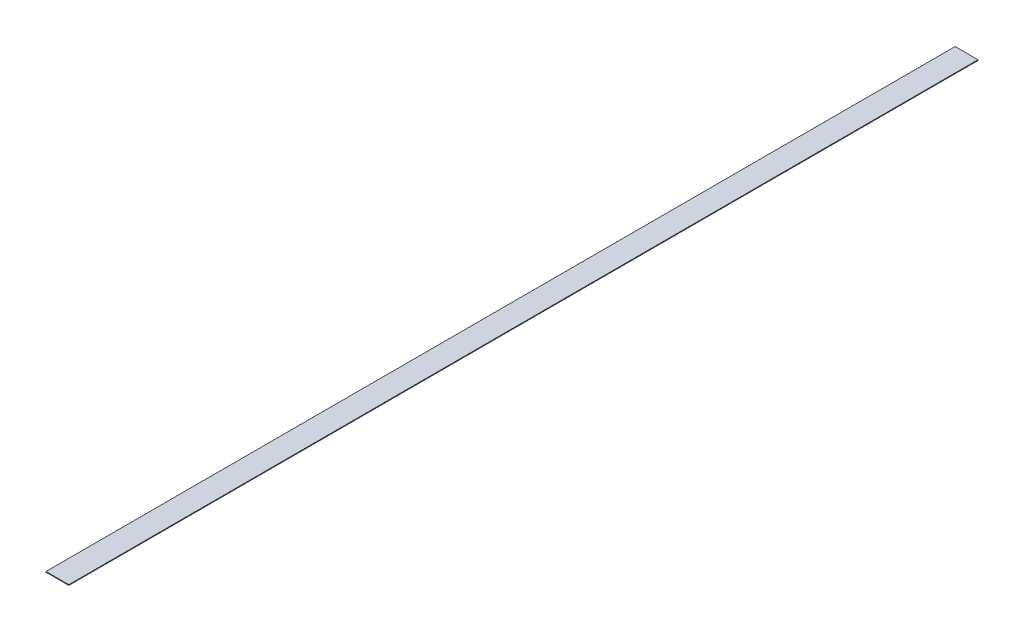
ISO-10303-21;
HEADER;
FILE_DESCRIPTION(('STEP AP214'),'2;1');
FILE_NAME('part.step','',(''),(''),'','','');
FILE_SCHEMA(('AUTOMOTIVE_DESIGN { 1 0 10303 214 1 1 1 1 }'));
ENDSEC;
DATA;
#1=APPLICATION_CONTEXT('core data for automotive mechanical design processes');
#2=APPLICATION_PROTOCOL_DEFINITION('international standard','automotive_design',2000,#1);
#3=PRODUCT_CONTEXT('',#1,'mechanical');
#4=PRODUCT('Part','Part','',(#3));
#5=PRODUCT_RELATED_PRODUCT_CATEGORY('part','',(#4));
#6=PRODUCT_DEFINITION_FORMATION('','',#4);
#7=PRODUCT_DEFINITION_CONTEXT('part definition',#1,'design');
#8=PRODUCT_DEFINITION('design','',#6,#7);
#9=PRODUCT_DEFINITION_SHAPE('','',#8);
#10=(LENGTH_UNIT() NAMED_UNIT(*) SI_UNIT(.MILLI.,.METRE.));
#11=(NAMED_UNIT(*) PLANE_ANGLE_UNIT() SI_UNIT($,.RADIAN.));
#12=(NAMED_UNIT(*) SI_UNIT($,.STERADIAN.) SOLID_ANGLE_UNIT());
#13=UNCERTAINTY_MEASURE_WITH_UNIT(LENGTH_MEASURE(1.E-05),#10,'distance_accuracy_value','');
#14=(GEOMETRIC_REPRESENTATION_CONTEXT(3) GLOBAL_UNCERTAINTY_ASSIGNED_CONTEXT((#13)) GLOBAL_UNIT_ASSIGNED_CONTEXT((#10,
#11,#12)) REPRESENTATION_CONTEXT('',''));
#15=CARTESIAN_POINT('',(0.,0.,0.));
#16=DIRECTION('',(0.,0.,1.));
#17=DIRECTION('',(1.,0.,0.));
#18=AXIS2_PLACEMENT_3D('',#15,#16,#17);
#19=CARTESIAN_POINT('',(25.4,1.5875,1011.2375));
#20=DIRECTION('',(-1.,0.,0.));
#21=DIRECTION('',(0.,0.,1.));
#22=AXIS2_PLACEMENT_3D('',#19,#20,#21);
#23=PLANE('',#22);
#24=DIRECTION('',(0.,0.,-1.));
#25=VECTOR('',#24,1.);
#26=CARTESIAN_POINT('',(25.4,0.,1011.2375));
#27=LINE('',#26,#25);
#28=CARTESIAN_POINT('',(25.4,0.,1011.2375));
#29=VERTEX_POINT('',#28);
#30=CARTESIAN_POINT('',(25.4,0.,-1011.2375));
#31=VERTEX_POINT('',#30);
#32=EDGE_CURVE('E97',#29,#31,#27,.T.);
#33=ORIENTED_EDGE('',*,*,#32,.T.);
#34=DIRECTION('',(0.,-1.,0.));
#35=VECTOR('',#34,1.);
#36=CARTESIAN_POINT('',(25.4,1.5875,-1011.2375));
#37=LINE('',#36,#35);
#38=CARTESIAN_POINT('',(25.4,1.5875,-1011.2375));
#39=VERTEX_POINT('',#38);
#40=EDGE_CURVE('E11',#39,#31,#37,.T.);
#41=ORIENTED_EDGE('',*,*,#40,.F.);
#42=DIRECTION('',(0.,0.,-1.));
#43=VECTOR('',#42,1.);
#44=CARTESIAN_POINT('',(25.4,1.5875,1011.2375));
#45=LINE('',#44,#43);
#46=CARTESIAN_POINT('',(25.4,1.5875,1011.2375));
#47=VERTEX_POINT('',#46);
#48=EDGE_CURVE('E85',#47,#39,#45,.T.);
#49=ORIENTED_EDGE('',*,*,#48,.F.);
#50=DIRECTION('',(0.,-1.,0.));
#51=VECTOR('',#50,1.);
#52=CARTESIAN_POINT('',(25.4,1.5875,1011.2375));
#53=LINE('',#52,#51);
#54=EDGE_CURVE('E93',#47,#29,#53,.T.);
#55=ORIENTED_EDGE('',*,*,#54,.T.);
#56=EDGE_LOOP('',(#33,#41,#49,#55));
#57=FACE_BOUND('',#56,.T.);
#58=ADVANCED_FACE('F34',(#57),#23,.F.);
#59=CARTESIAN_POINT('',(-25.4,1.5875,-1011.2375));
#60=DIRECTION('',(0.,0.,1.));
#61=DIRECTION('',(1.,0.,0.));
#62=AXIS2_PLACEMENT_3D('',#59,#60,#61);
#63=PLANE('',#62);
#64=DIRECTION('',(-1.,0.,0.));
#65=VECTOR('',#64,1.);
#66=CARTESIAN_POINT('',(-25.4,0.,-1011.2375));
#67=LINE('',#66,#65);
#68=CARTESIAN_POINT('',(-25.4,0.,-1011.2375));
#69=VERTEX_POINT('',#68);
#70=EDGE_CURVE('E89',#31,#69,#67,.T.);
#71=ORIENTED_EDGE('',*,*,#70,.T.);
#72=DIRECTION('',(0.,-1.,0.));
#73=VECTOR('',#72,1.);
#74=CARTESIAN_POINT('',(-25.4,1.5875,-1011.2375));
#75=LINE('',#74,#73);
#76=CARTESIAN_POINT('',(-25.4,1.5875,-1011.2375));
#77=VERTEX_POINT('',#76);
#78=EDGE_CURVE('E42',#77,#69,#75,.T.);
#79=ORIENTED_EDGE('',*,*,#78,.F.);
#80=DIRECTION('',(-1.,0.,0.));
#81=VECTOR('',#80,1.);
#82=CARTESIAN_POINT('',(-25.4,1.5875,-1011.2375));
#83=LINE('',#82,#81);
#84=EDGE_CURVE('E80',#39,#77,#83,.T.);
#85=ORIENTED_EDGE('',*,*,#84,.F.);
#86=ORIENTED_EDGE('',*,*,#40,.T.);
#87=EDGE_LOOP('',(#71,#79,#85,#86));
#88=FACE_BOUND('',#87,.T.);
#89=ADVANCED_FACE('F88',(#88),#63,.F.);
#90=CARTESIAN_POINT('',(-25.4,1.5875,1011.2375));
#91=DIRECTION('',(1.,0.,0.));
#92=DIRECTION('',(0.,0.,-1.));
#93=AXIS2_PLACEMENT_3D('',#90,#91,#92);
#94=PLANE('',#93);
#95=DIRECTION('',(0.,0.,1.));
#96=VECTOR('',#95,1.);
#97=CARTESIAN_POINT('',(-25.4,0.,1011.2375));
#98=LINE('',#97,#96);
#99=CARTESIAN_POINT('',(-25.4,0.,1011.2375));
#100=VERTEX_POINT('',#99);
#101=EDGE_CURVE('E67',#69,#100,#98,.T.);
#102=ORIENTED_EDGE('',*,*,#101,.T.);
#103=DIRECTION('',(0.,-1.,0.));
#104=VECTOR('',#103,1.);
#105=CARTESIAN_POINT('',(-25.4,1.5875,1011.2375));
#106=LINE('',#105,#104);
#107=CARTESIAN_POINT('',(-25.4,1.5875,1011.2375));
#108=VERTEX_POINT('',#107);
#109=EDGE_CURVE('E90',#108,#100,#106,.T.);
#110=ORIENTED_EDGE('',*,*,#109,.F.);
#111=DIRECTION('',(0.,0.,1.));
#112=VECTOR('',#111,1.);
#113=CARTESIAN_POINT('',(-25.4,1.5875,1011.2375));
#114=LINE('',#113,#112);
#115=EDGE_CURVE('E83',#77,#108,#114,.T.);
#116=ORIENTED_EDGE('',*,*,#115,.F.);
#117=ORIENTED_EDGE('',*,*,#78,.T.);
#118=EDGE_LOOP('',(#102,#110,#116,#117));
#119=FACE_BOUND('',#118,.T.);
#120=ADVANCED_FACE('F91',(#119),#94,.F.);
#121=CARTESIAN_POINT('',(-25.4,1.5875,1011.2375));
#122=DIRECTION('',(0.,0.,-1.));
#123=DIRECTION('',(-1.,0.,0.));
#124=AXIS2_PLACEMENT_3D('',#121,#122,#123);
#125=PLANE('',#124);
#126=DIRECTION('',(1.,0.,0.));
#127=VECTOR('',#126,1.);
#128=CARTESIAN_POINT('',(-25.4,0.,1011.2375));
#129=LINE('',#128,#127);
#130=EDGE_CURVE('E73',#100,#29,#129,.T.);
#131=ORIENTED_EDGE('',*,*,#130,.T.);
#132=ORIENTED_EDGE('',*,*,#54,.F.);
#133=DIRECTION('',(1.,0.,0.));
#134=VECTOR('',#133,1.);
#135=CARTESIAN_POINT('',(-25.4,1.5875,1011.2375));
#136=LINE('',#135,#134);
#137=EDGE_CURVE('E50',#108,#47,#136,.T.);
#138=ORIENTED_EDGE('',*,*,#137,.F.);
#139=ORIENTED_EDGE('',*,*,#109,.T.);
#140=EDGE_LOOP('',(#131,#132,#138,#139));
#141=FACE_BOUND('',#140,.T.);
#142=ADVANCED_FACE('F104',(#141),#125,.F.);
#143=CARTESIAN_POINT('',(0.,1.5875,0.));
#144=DIRECTION('',(0.,-1.,0.));
#145=DIRECTION('',(0.,0.,-1.));
#146=AXIS2_PLACEMENT_3D('',#143,#144,#145);
#147=PLANE('',#146);
#148=ORIENTED_EDGE('',*,*,#48,.T.);
#149=ORIENTED_EDGE('',*,*,#84,.T.);
#150=ORIENTED_EDGE('',*,*,#115,.T.);
#151=ORIENTED_EDGE('',*,*,#137,.T.);
#152=EDGE_LOOP('',(#148,#149,#150,#151));
#153=FACE_BOUND('',#152,.T.);
#154=ADVANCED_FACE('F81',(#153),#147,.F.);
#155=CARTESIAN_POINT('',(0.,0.,0.));
#156=DIRECTION('',(0.,-1.,0.));
#157=DIRECTION('',(0.,0.,-1.));
#158=AXIS2_PLACEMENT_3D('',#155,#156,#157);
#159=PLANE('',#158);
#160=ORIENTED_EDGE('',*,*,#32,.F.);
#161=ORIENTED_EDGE('',*,*,#130,.F.);
#162=ORIENTED_EDGE('',*,*,#101,.F.);
#163=ORIENTED_EDGE('',*,*,#70,.F.);
#164=EDGE_LOOP('',(#160,#161,#162,#163));
#165=FACE_BOUND('',#164,.T.);
#166=ADVANCED_FACE('F107',(#165),#159,.T.);
#167=CLOSED_SHELL('',(#58,#89,#120,#142,#154,#166));
#168=MANIFOLD_SOLID_BREP('B2',#167);
#169=ADVANCED_BREP_SHAPE_REPRESENTATION('',(#18,#168),#14);
#170=SHAPE_DEFINITION_REPRESENTATION(#9,#169);
ENDSEC;
END-ISO-10303-21;
